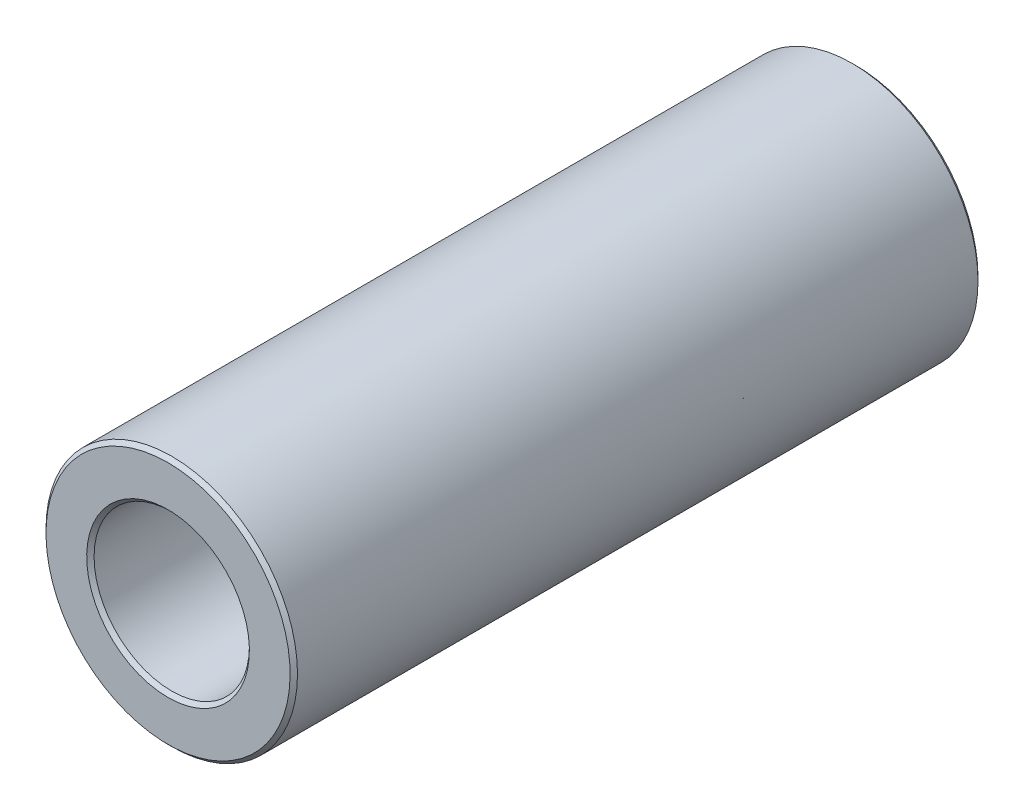
ISO-10303-21;
HEADER;
FILE_DESCRIPTION(('STEP AP214'),'2;1');
FILE_NAME('part.step','',(''),(''),'','','');
FILE_SCHEMA(('AUTOMOTIVE_DESIGN { 1 0 10303 214 1 1 1 1 }'));
ENDSEC;
DATA;
#1=APPLICATION_CONTEXT('core data for automotive mechanical design processes');
#2=APPLICATION_PROTOCOL_DEFINITION('international standard','automotive_design',2000,#1);
#3=PRODUCT_CONTEXT('',#1,'mechanical');
#4=PRODUCT('Part','Part','',(#3));
#5=PRODUCT_RELATED_PRODUCT_CATEGORY('part','',(#4));
#6=PRODUCT_DEFINITION_FORMATION('','',#4);
#7=PRODUCT_DEFINITION_CONTEXT('part definition',#1,'design');
#8=PRODUCT_DEFINITION('design','',#6,#7);
#9=PRODUCT_DEFINITION_SHAPE('','',#8);
#10=(LENGTH_UNIT() NAMED_UNIT(*) SI_UNIT(.MILLI.,.METRE.));
#11=(NAMED_UNIT(*) PLANE_ANGLE_UNIT() SI_UNIT($,.RADIAN.));
#12=(NAMED_UNIT(*) SI_UNIT($,.STERADIAN.) SOLID_ANGLE_UNIT());
#13=UNCERTAINTY_MEASURE_WITH_UNIT(LENGTH_MEASURE(1.E-05),#10,'distance_accuracy_value','');
#14=(GEOMETRIC_REPRESENTATION_CONTEXT(3) GLOBAL_UNCERTAINTY_ASSIGNED_CONTEXT((#13)) GLOBAL_UNIT_ASSIGNED_CONTEXT((#10,
#11,#12)) REPRESENTATION_CONTEXT('',''));
#15=CARTESIAN_POINT('',(0.,0.,0.));
#16=DIRECTION('',(0.,0.,1.));
#17=DIRECTION('',(1.,0.,0.));
#18=AXIS2_PLACEMENT_3D('',#15,#16,#17);
#19=CARTESIAN_POINT('',(0.,0.,47.244));
#20=DIRECTION('',(0.,0.,-1.));
#21=DIRECTION('',(-1.,0.,0.));
#22=AXIS2_PLACEMENT_3D('',#19,#20,#21);
#23=CYLINDRICAL_SURFACE('',#22,5.334);
#24=CARTESIAN_POINT('',(0.,0.,0.254000000040833));
#25=DIRECTION('',(0.,0.,-1.));
#26=DIRECTION('',(-1.,0.,0.));
#27=AXIS2_PLACEMENT_3D('',#24,#25,#26);
#28=CIRCLE('',#27,5.33399999994799);
#29=CARTESIAN_POINT('',(-5.33399999994799,0.,0.254000000040833));
#30=VERTEX_POINT('',#29);
#31=EDGE_CURVE('E30',#30,#30,#28,.T.);
#32=ORIENTED_EDGE('',*,*,#31,.T.);
#33=EDGE_LOOP('',(#32));
#34=FACE_BOUND('',#33,.T.);
#35=CARTESIAN_POINT('',(0.,0.,46.9900000000507));
#36=DIRECTION('',(0.,0.,1.));
#37=DIRECTION('',(1.,0.,0.));
#38=AXIS2_PLACEMENT_3D('',#35,#36,#37);
#39=CIRCLE('',#38,5.33400000000483);
#40=CARTESIAN_POINT('',(5.33400000000483,0.,46.9900000000507));
#41=VERTEX_POINT('',#40);
#42=EDGE_CURVE('E33',#41,#41,#39,.T.);
#43=ORIENTED_EDGE('',*,*,#42,.T.);
#44=EDGE_LOOP('',(#43));
#45=FACE_BOUND('',#44,.T.);
#46=ADVANCED_FACE('F15',(#34,#45),#23,.F.);
#47=CARTESIAN_POINT('',(0.,0.,47.2440000000347));
#48=DIRECTION('',(0.,0.,1.));
#49=DIRECTION('',(0.,-1.,0.));
#50=AXIS2_PLACEMENT_3D('',#47,#48,#49);
#51=CONICAL_SURFACE('',#50,5.58799999998882,0.785398163397448);
#52=ORIENTED_EDGE('',*,*,#42,.F.);
#53=EDGE_LOOP('',(#52));
#54=FACE_BOUND('',#53,.T.);
#55=CARTESIAN_POINT('',(0.,0.,47.2440000000347));
#56=DIRECTION('',(0.,0.,1.));
#57=DIRECTION('',(0.,-1.,0.));
#58=AXIS2_PLACEMENT_3D('',#55,#56,#57);
#59=CIRCLE('',#58,5.58799999998882);
#60=CARTESIAN_POINT('',(0.,-5.58799999998882,47.2440000000347));
#61=VERTEX_POINT('',#60);
#62=EDGE_CURVE('E18',#61,#61,#59,.F.);
#63=ORIENTED_EDGE('',*,*,#62,.F.);
#64=EDGE_LOOP('',(#63));
#65=FACE_BOUND('',#64,.T.);
#66=ADVANCED_FACE('F49',(#54,#65),#51,.F.);
#67=CARTESIAN_POINT('',(0.,0.,1.13686837721616E-10));
#68=DIRECTION('',(0.,0.,-1.));
#69=DIRECTION('',(-1.,0.,0.));
#70=AXIS2_PLACEMENT_3D('',#67,#68,#69);
#71=CONICAL_SURFACE('',#70,5.58799999987514,0.785398163397448);
#72=CARTESIAN_POINT('',(0.,0.,5.6843418860808E-11));
#73=DIRECTION('',(0.,0.,-1.));
#74=DIRECTION('',(-1.,0.,0.));
#75=AXIS2_PLACEMENT_3D('',#72,#73,#74);
#76=CIRCLE('',#75,5.58799999993198);
#77=CARTESIAN_POINT('',(-5.58799999993198,0.,5.6843418860808E-11));
#78=VERTEX_POINT('',#77);
#79=EDGE_CURVE('E40',#78,#78,#76,.T.);
#80=ORIENTED_EDGE('',*,*,#79,.T.);
#81=EDGE_LOOP('',(#80));
#82=FACE_BOUND('',#81,.T.);
#83=ORIENTED_EDGE('',*,*,#31,.F.);
#84=EDGE_LOOP('',(#83));
#85=FACE_BOUND('',#84,.T.);
#86=ADVANCED_FACE('F51',(#82,#85),#71,.F.);
#87=CARTESIAN_POINT('',(0.,0.,47.244));
#88=DIRECTION('',(0.,0.,1.));
#89=DIRECTION('',(1.,0.,0.));
#90=AXIS2_PLACEMENT_3D('',#87,#88,#89);
#91=PLANE('',#90);
#92=CARTESIAN_POINT('',(0.,0.,47.244));
#93=DIRECTION('',(0.,0.,-1.));
#94=DIRECTION('',(0.,1.,0.));
#95=AXIS2_PLACEMENT_3D('',#92,#93,#94);
#96=CIRCLE('',#95,8.382);
#97=CARTESIAN_POINT('',(0.,8.382,47.244));
#98=VERTEX_POINT('',#97);
#99=EDGE_CURVE('E38',#98,#98,#96,.T.);
#100=ORIENTED_EDGE('',*,*,#99,.F.);
#101=EDGE_LOOP('',(#100));
#102=FACE_BOUND('',#101,.T.);
#103=ORIENTED_EDGE('',*,*,#62,.T.);
#104=EDGE_LOOP('',(#103));
#105=FACE_BOUND('',#104,.T.);
#106=ADVANCED_FACE('F47',(#102,#105),#91,.T.);
#107=CARTESIAN_POINT('',(0.,0.,0.));
#108=DIRECTION('',(0.,0.,1.));
#109=DIRECTION('',(1.,0.,0.));
#110=AXIS2_PLACEMENT_3D('',#107,#108,#109);
#111=PLANE('',#110);
#112=ORIENTED_EDGE('',*,*,#79,.F.);
#113=EDGE_LOOP('',(#112));
#114=FACE_BOUND('',#113,.T.);
#115=CARTESIAN_POINT('',(0.,0.,0.));
#116=DIRECTION('',(0.,0.,1.));
#117=DIRECTION('',(1.,0.,0.));
#118=AXIS2_PLACEMENT_3D('',#115,#116,#117);
#119=CIRCLE('',#118,8.382);
#120=CARTESIAN_POINT('',(8.382,0.,0.));
#121=VERTEX_POINT('',#120);
#122=EDGE_CURVE('E27',#121,#121,#119,.T.);
#123=ORIENTED_EDGE('',*,*,#122,.F.);
#124=EDGE_LOOP('',(#123));
#125=FACE_BOUND('',#124,.T.);
#126=ADVANCED_FACE('F75',(#114,#125),#111,.F.);
#127=CARTESIAN_POINT('',(0.,0.,46.99));
#128=DIRECTION('',(0.,0.,-1.));
#129=DIRECTION('',(0.,1.,0.));
#130=AXIS2_PLACEMENT_3D('',#127,#128,#129);
#131=CONICAL_SURFACE('',#130,8.636,0.785398163397438);
#132=CARTESIAN_POINT('',(0.,0.,46.99));
#133=DIRECTION('',(0.,0.,-1.));
#134=DIRECTION('',(-1.,0.,0.));
#135=AXIS2_PLACEMENT_3D('',#132,#133,#134);
#136=CIRCLE('',#135,8.636);
#137=CARTESIAN_POINT('',(-8.636,0.,46.99));
#138=VERTEX_POINT('',#137);
#139=EDGE_CURVE('E22',#138,#138,#136,.T.);
#140=ORIENTED_EDGE('',*,*,#139,.F.);
#141=EDGE_LOOP('',(#140));
#142=FACE_BOUND('',#141,.T.);
#143=ORIENTED_EDGE('',*,*,#99,.T.);
#144=EDGE_LOOP('',(#143));
#145=FACE_BOUND('',#144,.T.);
#146=ADVANCED_FACE('F68',(#142,#145),#131,.T.);
#147=CARTESIAN_POINT('',(0.,0.,0.254000000000004));
#148=DIRECTION('',(0.,0.,1.));
#149=DIRECTION('',(1.,0.,0.));
#150=AXIS2_PLACEMENT_3D('',#147,#148,#149);
#151=CONICAL_SURFACE('',#150,8.636,0.785398163397445);
#152=CARTESIAN_POINT('',(0.,0.,0.254000000000004));
#153=DIRECTION('',(0.,0.,-1.));
#154=DIRECTION('',(-1.,0.,0.));
#155=AXIS2_PLACEMENT_3D('',#152,#153,#154);
#156=CIRCLE('',#155,8.636);
#157=CARTESIAN_POINT('',(-8.636,0.,0.254000000000004));
#158=VERTEX_POINT('',#157);
#159=EDGE_CURVE('E10',#158,#158,#156,.F.);
#160=ORIENTED_EDGE('',*,*,#159,.F.);
#161=EDGE_LOOP('',(#160));
#162=FACE_BOUND('',#161,.T.);
#163=ORIENTED_EDGE('',*,*,#122,.T.);
#164=EDGE_LOOP('',(#163));
#165=FACE_BOUND('',#164,.T.);
#166=ADVANCED_FACE('F63',(#162,#165),#151,.T.);
#167=CARTESIAN_POINT('',(0.,0.,47.244));
#168=DIRECTION('',(0.,0.,-1.));
#169=DIRECTION('',(-1.,0.,0.));
#170=AXIS2_PLACEMENT_3D('',#167,#168,#169);
#171=CYLINDRICAL_SURFACE('',#170,8.636);
#172=ORIENTED_EDGE('',*,*,#159,.T.);
#173=EDGE_LOOP('',(#172));
#174=FACE_BOUND('',#173,.T.);
#175=ORIENTED_EDGE('',*,*,#139,.T.);
#176=EDGE_LOOP('',(#175));
#177=FACE_BOUND('',#176,.T.);
#178=ADVANCED_FACE('F61',(#174,#177),#171,.T.);
#179=CLOSED_SHELL('',(#46,#66,#86,#106,#126,#146,#166,#178));
#180=MANIFOLD_SOLID_BREP('B1',#179);
#181=ADVANCED_BREP_SHAPE_REPRESENTATION('',(#18,#180),#14);
#182=SHAPE_DEFINITION_REPRESENTATION(#9,#181);
ENDSEC;
END-ISO-10303-21;
